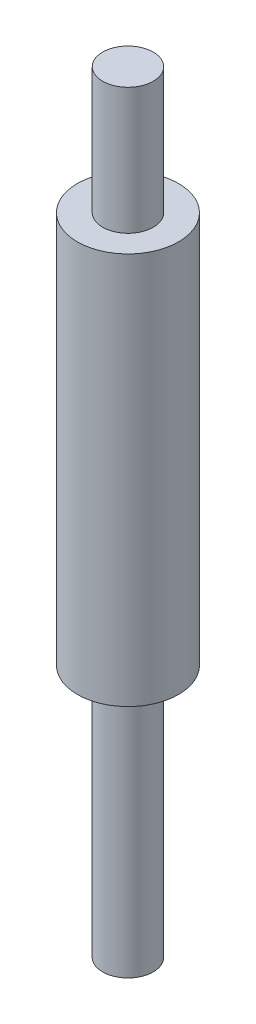
ISO-10303-21;
HEADER;
FILE_DESCRIPTION(('STEP AP214'),'2;1');
FILE_NAME('part.step','',(''),(''),'','','');
FILE_SCHEMA(('AUTOMOTIVE_DESIGN { 1 0 10303 214 1 1 1 1 }'));
ENDSEC;
DATA;
#1=APPLICATION_CONTEXT('core data for automotive mechanical design processes');
#2=APPLICATION_PROTOCOL_DEFINITION('international standard','automotive_design',2000,#1);
#3=PRODUCT_CONTEXT('',#1,'mechanical');
#4=PRODUCT('Part','Part','',(#3));
#5=PRODUCT_RELATED_PRODUCT_CATEGORY('part','',(#4));
#6=PRODUCT_DEFINITION_FORMATION('','',#4);
#7=PRODUCT_DEFINITION_CONTEXT('part definition',#1,'design');
#8=PRODUCT_DEFINITION('design','',#6,#7);
#9=PRODUCT_DEFINITION_SHAPE('','',#8);
#10=(LENGTH_UNIT() NAMED_UNIT(*) SI_UNIT(.MILLI.,.METRE.));
#11=(NAMED_UNIT(*) PLANE_ANGLE_UNIT() SI_UNIT($,.RADIAN.));
#12=(NAMED_UNIT(*) SI_UNIT($,.STERADIAN.) SOLID_ANGLE_UNIT());
#13=UNCERTAINTY_MEASURE_WITH_UNIT(LENGTH_MEASURE(1.E-05),#10,'distance_accuracy_value','');
#14=(GEOMETRIC_REPRESENTATION_CONTEXT(3) GLOBAL_UNCERTAINTY_ASSIGNED_CONTEXT((#13)) GLOBAL_UNIT_ASSIGNED_CONTEXT((#10,
#11,#12)) REPRESENTATION_CONTEXT('',''));
#15=CARTESIAN_POINT('',(0.,0.,0.));
#16=DIRECTION('',(0.,0.,1.));
#17=DIRECTION('',(1.,0.,0.));
#18=AXIS2_PLACEMENT_3D('',#15,#16,#17);
#19=CARTESIAN_POINT('',(0.,31.,0.));
#20=DIRECTION('',(0.,-1.,0.));
#21=DIRECTION('',(0.,0.,-1.));
#22=AXIS2_PLACEMENT_3D('',#19,#20,#21);
#23=CYLINDRICAL_SURFACE('',#22,4.);
#24=CARTESIAN_POINT('',(0.,31.,0.));
#25=DIRECTION('',(0.,1.,0.));
#26=DIRECTION('',(0.,0.,1.));
#27=AXIS2_PLACEMENT_3D('',#24,#25,#26);
#28=CIRCLE('',#27,4.);
#29=CARTESIAN_POINT('',(0.,31.,4.));
#30=VERTEX_POINT('',#29);
#31=EDGE_CURVE('E41',#30,#30,#28,.T.);
#32=ORIENTED_EDGE('',*,*,#31,.F.);
#33=EDGE_LOOP('',(#32));
#34=FACE_BOUND('',#33,.T.);
#35=CARTESIAN_POINT('',(0.,0.,0.));
#36=DIRECTION('',(0.,1.,0.));
#37=DIRECTION('',(0.,0.,1.));
#38=AXIS2_PLACEMENT_3D('',#35,#36,#37);
#39=CIRCLE('',#38,4.);
#40=CARTESIAN_POINT('',(0.,0.,4.));
#41=VERTEX_POINT('',#40);
#42=EDGE_CURVE('E46',#41,#41,#39,.T.);
#43=ORIENTED_EDGE('',*,*,#42,.T.);
#44=EDGE_LOOP('',(#43));
#45=FACE_BOUND('',#44,.T.);
#46=ADVANCED_FACE('F34',(#34,#45),#23,.T.);
#47=CARTESIAN_POINT('',(0.,31.,0.));
#48=DIRECTION('',(0.,1.,0.));
#49=DIRECTION('',(0.,0.,1.));
#50=AXIS2_PLACEMENT_3D('',#47,#48,#49);
#51=PLANE('',#50);
#52=CARTESIAN_POINT('',(0.,31.,0.));
#53=DIRECTION('',(0.,1.,0.));
#54=DIRECTION('',(0.,0.,1.));
#55=AXIS2_PLACEMENT_3D('',#52,#53,#54);
#56=CIRCLE('',#55,2.);
#57=CARTESIAN_POINT('',(0.,31.,2.));
#58=VERTEX_POINT('',#57);
#59=EDGE_CURVE('E10',#58,#58,#56,.T.);
#60=ORIENTED_EDGE('',*,*,#59,.F.);
#61=EDGE_LOOP('',(#60));
#62=FACE_BOUND('',#61,.T.);
#63=ORIENTED_EDGE('',*,*,#31,.T.);
#64=EDGE_LOOP('',(#63));
#65=FACE_BOUND('',#64,.T.);
#66=ADVANCED_FACE('F79',(#62,#65),#51,.T.);
#67=CARTESIAN_POINT('',(0.,0.,0.));
#68=DIRECTION('',(0.,1.,0.));
#69=DIRECTION('',(0.,0.,1.));
#70=AXIS2_PLACEMENT_3D('',#67,#68,#69);
#71=PLANE('',#70);
#72=CARTESIAN_POINT('',(0.,0.,0.));
#73=DIRECTION('',(0.,1.,0.));
#74=DIRECTION('',(0.,0.,1.));
#75=AXIS2_PLACEMENT_3D('',#72,#73,#74);
#76=CIRCLE('',#75,2.);
#77=CARTESIAN_POINT('',(0.,0.,2.));
#78=VERTEX_POINT('',#77);
#79=EDGE_CURVE('E37',#78,#78,#76,.T.);
#80=ORIENTED_EDGE('',*,*,#79,.T.);
#81=EDGE_LOOP('',(#80));
#82=FACE_BOUND('',#81,.T.);
#83=ORIENTED_EDGE('',*,*,#42,.F.);
#84=EDGE_LOOP('',(#83));
#85=FACE_BOUND('',#84,.T.);
#86=ADVANCED_FACE('F84',(#82,#85),#71,.F.);
#87=CARTESIAN_POINT('',(0.,-20.,0.));
#88=DIRECTION('',(0.,1.,0.));
#89=DIRECTION('',(0.,0.,1.));
#90=AXIS2_PLACEMENT_3D('',#87,#88,#89);
#91=PLANE('',#90);
#92=CARTESIAN_POINT('',(0.,-20.,0.));
#93=DIRECTION('',(0.,1.,0.));
#94=DIRECTION('',(0.,0.,1.));
#95=AXIS2_PLACEMENT_3D('',#92,#93,#94);
#96=CIRCLE('',#95,2.);
#97=CARTESIAN_POINT('',(0.,-20.,2.));
#98=VERTEX_POINT('',#97);
#99=EDGE_CURVE('E49',#98,#98,#96,.T.);
#100=ORIENTED_EDGE('',*,*,#99,.F.);
#101=EDGE_LOOP('',(#100));
#102=FACE_BOUND('',#101,.T.);
#103=ADVANCED_FACE('F75',(#102),#91,.F.);
#104=CARTESIAN_POINT('',(0.,-20.,0.));
#105=DIRECTION('',(0.,1.,0.));
#106=DIRECTION('',(0.,0.,1.));
#107=AXIS2_PLACEMENT_3D('',#104,#105,#106);
#108=CYLINDRICAL_SURFACE('',#107,2.);
#109=ORIENTED_EDGE('',*,*,#99,.T.);
#110=EDGE_LOOP('',(#109));
#111=FACE_BOUND('',#110,.T.);
#112=ORIENTED_EDGE('',*,*,#79,.F.);
#113=EDGE_LOOP('',(#112));
#114=FACE_BOUND('',#113,.T.);
#115=ADVANCED_FACE('F68',(#111,#114),#108,.T.);
#116=ORIENTED_EDGE('',*,*,#59,.T.);
#117=EDGE_LOOP('',(#116));
#118=FACE_BOUND('',#117,.T.);
#119=CARTESIAN_POINT('',(0.,41.,0.));
#120=DIRECTION('',(0.,1.,0.));
#121=DIRECTION('',(0.,0.,1.));
#122=AXIS2_PLACEMENT_3D('',#119,#120,#121);
#123=CIRCLE('',#122,2.);
#124=CARTESIAN_POINT('',(0.,41.,2.));
#125=VERTEX_POINT('',#124);
#126=EDGE_CURVE('E58',#125,#125,#123,.T.);
#127=ORIENTED_EDGE('',*,*,#126,.F.);
#128=EDGE_LOOP('',(#127));
#129=FACE_BOUND('',#128,.T.);
#130=ADVANCED_FACE('F66',(#118,#129),#108,.T.);
#131=CARTESIAN_POINT('',(0.,41.,0.));
#132=DIRECTION('',(0.,1.,0.));
#133=DIRECTION('',(0.,0.,1.));
#134=AXIS2_PLACEMENT_3D('',#131,#132,#133);
#135=PLANE('',#134);
#136=ORIENTED_EDGE('',*,*,#126,.T.);
#137=EDGE_LOOP('',(#136));
#138=FACE_BOUND('',#137,.T.);
#139=ADVANCED_FACE('F64',(#138),#135,.T.);
#140=CLOSED_SHELL('',(#46,#66,#86,#103,#115,#130,#139));
#141=MANIFOLD_SOLID_BREP('B2',#140);
#142=ADVANCED_BREP_SHAPE_REPRESENTATION('',(#18,#141),#14);
#143=SHAPE_DEFINITION_REPRESENTATION(#9,#142);
ENDSEC;
END-ISO-10303-21;
